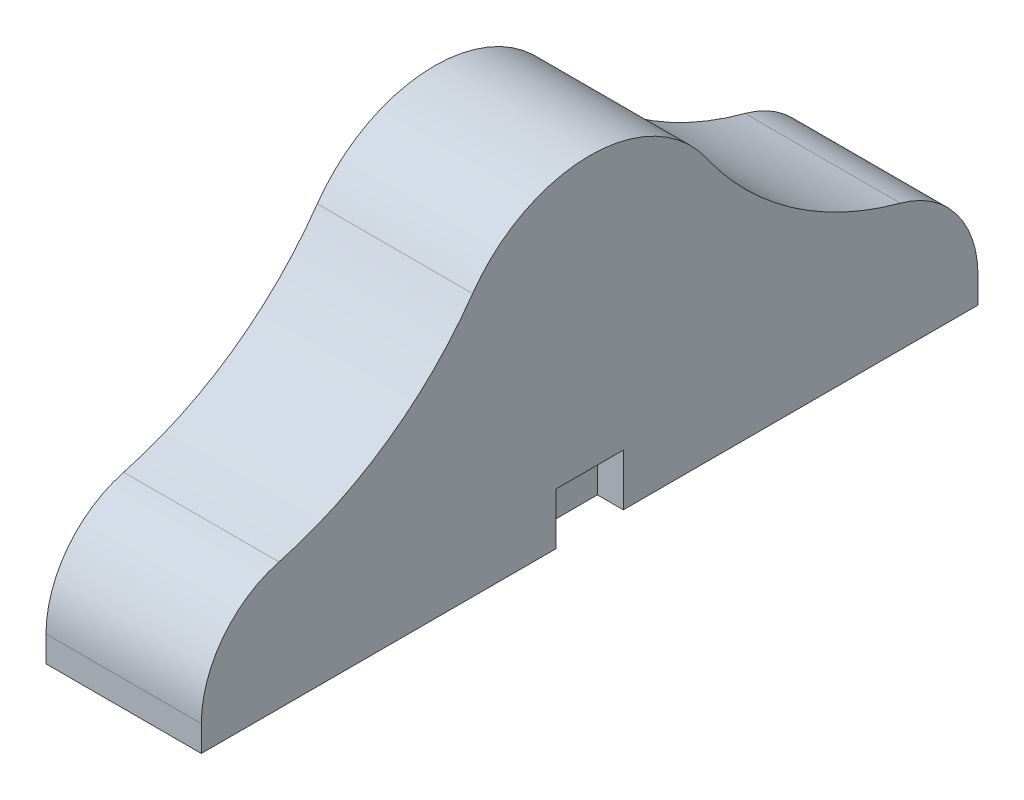
ISO-10303-21;
HEADER;
FILE_DESCRIPTION(('STEP AP214'),'2;1');
FILE_NAME('part.step','',(''),(''),'','','');
FILE_SCHEMA(('AUTOMOTIVE_DESIGN { 1 0 10303 214 1 1 1 1 }'));
ENDSEC;
DATA;
#1=APPLICATION_CONTEXT('core data for automotive mechanical design processes');
#2=APPLICATION_PROTOCOL_DEFINITION('international standard','automotive_design',2000,#1);
#3=PRODUCT_CONTEXT('',#1,'mechanical');
#4=PRODUCT('Part','Part','',(#3));
#5=PRODUCT_RELATED_PRODUCT_CATEGORY('part','',(#4));
#6=PRODUCT_DEFINITION_FORMATION('','',#4);
#7=PRODUCT_DEFINITION_CONTEXT('part definition',#1,'design');
#8=PRODUCT_DEFINITION('design','',#6,#7);
#9=PRODUCT_DEFINITION_SHAPE('','',#8);
#10=(LENGTH_UNIT() NAMED_UNIT(*) SI_UNIT(.MILLI.,.METRE.));
#11=(NAMED_UNIT(*) PLANE_ANGLE_UNIT() SI_UNIT($,.RADIAN.));
#12=(NAMED_UNIT(*) SI_UNIT($,.STERADIAN.) SOLID_ANGLE_UNIT());
#13=UNCERTAINTY_MEASURE_WITH_UNIT(LENGTH_MEASURE(1.E-05),#10,'distance_accuracy_value','');
#14=(GEOMETRIC_REPRESENTATION_CONTEXT(3) GLOBAL_UNCERTAINTY_ASSIGNED_CONTEXT((#13)) GLOBAL_UNIT_ASSIGNED_CONTEXT((#10,
#11,#12)) REPRESENTATION_CONTEXT('',''));
#15=CARTESIAN_POINT('',(0.,0.,0.));
#16=DIRECTION('',(0.,0.,1.));
#17=DIRECTION('',(1.,0.,0.));
#18=AXIS2_PLACEMENT_3D('',#15,#16,#17);
#19=CARTESIAN_POINT('',(0.,1.99999999999998,-8.09518911725141));
#20=DIRECTION('',(-1.,0.,0.));
#21=DIRECTION('',(0.,0.,1.));
#22=AXIS2_PLACEMENT_3D('',#19,#20,#21);
#23=PLANE('',#22);
#24=DIRECTION('',(0.,-1.,0.));
#25=VECTOR('',#24,1.);
#26=CARTESIAN_POINT('',(0.,4.,-32.6));
#27=LINE('',#26,#25);
#28=CARTESIAN_POINT('',(0.,2.,-32.6));
#29=VERTEX_POINT('',#28);
#30=CARTESIAN_POINT('',(0.,0.,-32.6));
#31=VERTEX_POINT('',#30);
#32=EDGE_CURVE('E11',#29,#31,#27,.T.);
#33=ORIENTED_EDGE('',*,*,#32,.F.);
#34=DIRECTION('',(0.,0.,-1.));
#35=VECTOR('',#34,1.);
#36=CARTESIAN_POINT('',(0.,2.,-27.4));
#37=LINE('',#36,#35);
#38=CARTESIAN_POINT('',(0.,2.,-27.4));
#39=VERTEX_POINT('',#38);
#40=EDGE_CURVE('E190',#39,#29,#37,.T.);
#41=ORIENTED_EDGE('',*,*,#40,.F.);
#42=DIRECTION('',(0.,1.,0.));
#43=VECTOR('',#42,1.);
#44=CARTESIAN_POINT('',(0.,0.,-27.4));
#45=LINE('',#44,#43);
#46=CARTESIAN_POINT('',(0.,0.,-27.4));
#47=VERTEX_POINT('',#46);
#48=EDGE_CURVE('E58',#47,#39,#45,.T.);
#49=ORIENTED_EDGE('',*,*,#48,.F.);
#50=DIRECTION('',(0.,0.,-1.));
#51=VECTOR('',#50,1.);
#52=CARTESIAN_POINT('',(0.,0.,0.));
#53=LINE('',#52,#51);
#54=EDGE_CURVE('E206',#47,#31,#53,.T.);
#55=ORIENTED_EDGE('',*,*,#54,.T.);
#56=EDGE_LOOP('',(#33,#41,#49,#55));
#57=FACE_BOUND('',#56,.T.);
#58=ADVANCED_FACE('F33',(#57),#23,.F.);
#59=CARTESIAN_POINT('',(-10.,0.,0.));
#60=DIRECTION('',(0.,0.,1.));
#61=DIRECTION('',(1.,0.,0.));
#62=AXIS2_PLACEMENT_3D('',#59,#60,#61);
#63=PLANE('',#62);
#64=DIRECTION('',(1.,0.,0.));
#65=VECTOR('',#64,1.);
#66=CARTESIAN_POINT('',(-10.,0.,0.));
#67=LINE('',#66,#65);
#68=CARTESIAN_POINT('',(-10.,0.,0.));
#69=VERTEX_POINT('',#68);
#70=CARTESIAN_POINT('',(2.,0.,0.));
#71=VERTEX_POINT('',#70);
#72=EDGE_CURVE('E37',#69,#71,#67,.T.);
#73=ORIENTED_EDGE('',*,*,#72,.T.);
#74=DIRECTION('',(0.,-1.,0.));
#75=VECTOR('',#74,1.);
#76=CARTESIAN_POINT('',(2.,2.,0.));
#77=LINE('',#76,#75);
#78=CARTESIAN_POINT('',(2.,2.,0.));
#79=VERTEX_POINT('',#78);
#80=EDGE_CURVE('E148',#79,#71,#77,.T.);
#81=ORIENTED_EDGE('',*,*,#80,.F.);
#82=DIRECTION('',(1.,0.,0.));
#83=VECTOR('',#82,1.);
#84=CARTESIAN_POINT('',(-10.,2.,0.));
#85=LINE('',#84,#83);
#86=CARTESIAN_POINT('',(-10.,2.,0.));
#87=VERTEX_POINT('',#86);
#88=EDGE_CURVE('E42',#87,#79,#85,.T.);
#89=ORIENTED_EDGE('',*,*,#88,.F.);
#90=DIRECTION('',(0.,-1.,0.));
#91=VECTOR('',#90,1.);
#92=CARTESIAN_POINT('',(-10.,0.,0.));
#93=LINE('',#92,#91);
#94=EDGE_CURVE('E212',#87,#69,#93,.T.);
#95=ORIENTED_EDGE('',*,*,#94,.T.);
#96=EDGE_LOOP('',(#73,#81,#89,#95));
#97=FACE_BOUND('',#96,.T.);
#98=ADVANCED_FACE('F35',(#97),#63,.T.);
#99=CARTESIAN_POINT('',(-10.,1.99999999999998,-8.09518911725141));
#100=DIRECTION('',(1.,0.,0.));
#101=DIRECTION('',(0.,0.,-1.));
#102=AXIS2_PLACEMENT_3D('',#99,#100,#101);
#103=CYLINDRICAL_SURFACE('',#102,8.09518911725142);
#104=ORIENTED_EDGE('',*,*,#88,.T.);
#105=CARTESIAN_POINT('',(2.,1.99999999999998,-8.09518911725141));
#106=DIRECTION('',(1.,0.,0.));
#107=DIRECTION('',(0.,0.,-1.));
#108=AXIS2_PLACEMENT_3D('',#105,#106,#107);
#109=CIRCLE('',#108,8.09518911725139);
#110=CARTESIAN_POINT('',(2.,9.81935223704725,-6.00000000000002));
#111=VERTEX_POINT('',#110);
#112=EDGE_CURVE('E139',#111,#79,#109,.T.);
#113=ORIENTED_EDGE('',*,*,#112,.F.);
#114=DIRECTION('',(1.,0.,0.));
#115=VECTOR('',#114,1.);
#116=CARTESIAN_POINT('',(-10.,9.81935223704729,-6.00000000000001));
#117=LINE('',#116,#115);
#118=CARTESIAN_POINT('',(-10.,9.81935223704729,-6.00000000000001));
#119=VERTEX_POINT('',#118);
#120=EDGE_CURVE('E145',#119,#111,#117,.T.);
#121=ORIENTED_EDGE('',*,*,#120,.F.);
#122=CARTESIAN_POINT('',(-10.,1.99999999999998,-8.09518911725141));
#123=DIRECTION('',(1.,0.,0.));
#124=DIRECTION('',(0.,0.,1.));
#125=AXIS2_PLACEMENT_3D('',#122,#123,#124);
#126=CIRCLE('',#125,8.09518911725142);
#127=EDGE_CURVE('E141',#119,#87,#126,.T.);
#128=ORIENTED_EDGE('',*,*,#127,.T.);
#129=EDGE_LOOP('',(#104,#113,#121,#128));
#130=FACE_BOUND('',#129,.T.);
#131=ADVANCED_FACE('F137',(#130),#103,.T.);
#132=CARTESIAN_POINT('',(-10.,35.6043590283356,0.909071746556974));
#133=DIRECTION('',(1.,0.,0.));
#134=DIRECTION('',(0.,0.,-1.));
#135=AXIS2_PLACEMENT_3D('',#132,#133,#134);
#136=CYLINDRICAL_SURFACE('',#135,26.6946033427331);
#137=ORIENTED_EDGE('',*,*,#120,.T.);
#138=CARTESIAN_POINT('',(2.,35.6043590283356,0.909071746556974));
#139=DIRECTION('',(-1.,0.,0.));
#140=DIRECTION('',(0.,0.,-1.));
#141=AXIS2_PLACEMENT_3D('',#138,#139,#140);
#142=CIRCLE('',#141,26.6946033427332);
#143=CARTESIAN_POINT('',(2.,20.2929635732061,-20.9578671531267));
#144=VERTEX_POINT('',#143);
#145=EDGE_CURVE('E157',#144,#111,#142,.T.);
#146=ORIENTED_EDGE('',*,*,#145,.F.);
#147=DIRECTION('',(1.,0.,0.));
#148=VECTOR('',#147,1.);
#149=CARTESIAN_POINT('',(-10.,20.2929635732061,-20.9578671531267));
#150=LINE('',#149,#148);
#151=CARTESIAN_POINT('',(-10.,20.2929635732061,-20.9578671531267));
#152=VERTEX_POINT('',#151);
#153=EDGE_CURVE('E236',#152,#144,#150,.T.);
#154=ORIENTED_EDGE('',*,*,#153,.F.);
#155=CARTESIAN_POINT('',(-10.,35.6043590283356,0.909071746556974));
#156=DIRECTION('',(-1.,0.,0.));
#157=DIRECTION('',(0.,0.,-1.));
#158=AXIS2_PLACEMENT_3D('',#155,#156,#157);
#159=CIRCLE('',#158,26.6946033427331);
#160=EDGE_CURVE('E229',#152,#119,#159,.T.);
#161=ORIENTED_EDGE('',*,*,#160,.T.);
#162=EDGE_LOOP('',(#137,#146,#154,#161));
#163=FACE_BOUND('',#162,.T.);
#164=ADVANCED_FACE('F271',(#163),#136,.F.);
#165=CARTESIAN_POINT('',(-10.,13.9615939923318,-30.));
#166=DIRECTION('',(1.,0.,0.));
#167=DIRECTION('',(0.,0.,-1.));
#168=AXIS2_PLACEMENT_3D('',#165,#166,#167);
#169=CYLINDRICAL_SURFACE('',#168,11.0384060076682);
#170=ORIENTED_EDGE('',*,*,#153,.T.);
#171=CARTESIAN_POINT('',(2.,13.9615939923318,-30.));
#172=DIRECTION('',(1.,0.,0.));
#173=DIRECTION('',(0.,0.,-1.));
#174=AXIS2_PLACEMENT_3D('',#171,#172,#173);
#175=CIRCLE('',#174,11.0384060076682);
#176=CARTESIAN_POINT('',(2.,20.2929635732061,-39.0421328468733));
#177=VERTEX_POINT('',#176);
#178=EDGE_CURVE('E182',#177,#144,#175,.T.);
#179=ORIENTED_EDGE('',*,*,#178,.F.);
#180=DIRECTION('',(1.,0.,0.));
#181=VECTOR('',#180,1.);
#182=CARTESIAN_POINT('',(-10.,20.292963573206,-39.0421328468733));
#183=LINE('',#182,#181);
#184=CARTESIAN_POINT('',(-10.,20.292963573206,-39.0421328468733));
#185=VERTEX_POINT('',#184);
#186=EDGE_CURVE('E238',#185,#177,#183,.T.);
#187=ORIENTED_EDGE('',*,*,#186,.F.);
#188=CARTESIAN_POINT('',(-10.,13.9615939923318,-30.));
#189=DIRECTION('',(1.,0.,0.));
#190=DIRECTION('',(0.,0.,1.));
#191=AXIS2_PLACEMENT_3D('',#188,#189,#190);
#192=CIRCLE('',#191,11.0384060076682);
#193=EDGE_CURVE('E226',#185,#152,#192,.T.);
#194=ORIENTED_EDGE('',*,*,#193,.T.);
#195=EDGE_LOOP('',(#170,#179,#187,#194));
#196=FACE_BOUND('',#195,.T.);
#197=ADVANCED_FACE('F269',(#196),#169,.T.);
#198=CARTESIAN_POINT('',(-10.,35.6043590283357,-60.909071746557));
#199=DIRECTION('',(1.,0.,0.));
#200=DIRECTION('',(0.,0.,-1.));
#201=AXIS2_PLACEMENT_3D('',#198,#199,#200);
#202=CYLINDRICAL_SURFACE('',#201,26.6946033427332);
#203=ORIENTED_EDGE('',*,*,#186,.T.);
#204=CARTESIAN_POINT('',(2.,35.6043590283357,-60.909071746557));
#205=DIRECTION('',(-1.,0.,0.));
#206=DIRECTION('',(0.,0.,-1.));
#207=AXIS2_PLACEMENT_3D('',#204,#205,#206);
#208=CIRCLE('',#207,26.6946033427332);
#209=CARTESIAN_POINT('',(2.,9.81935223704726,-54.));
#210=VERTEX_POINT('',#209);
#211=EDGE_CURVE('E179',#210,#177,#208,.T.);
#212=ORIENTED_EDGE('',*,*,#211,.F.);
#213=DIRECTION('',(1.,0.,0.));
#214=VECTOR('',#213,1.);
#215=CARTESIAN_POINT('',(-10.,9.81935223704726,-54.));
#216=LINE('',#215,#214);
#217=CARTESIAN_POINT('',(-10.,9.81935223704726,-54.));
#218=VERTEX_POINT('',#217);
#219=EDGE_CURVE('E240',#218,#210,#216,.T.);
#220=ORIENTED_EDGE('',*,*,#219,.F.);
#221=CARTESIAN_POINT('',(-10.,35.6043590283357,-60.909071746557));
#222=DIRECTION('',(-1.,0.,0.));
#223=DIRECTION('',(0.,0.,1.));
#224=AXIS2_PLACEMENT_3D('',#221,#222,#223);
#225=CIRCLE('',#224,26.6946033427332);
#226=EDGE_CURVE('E223',#218,#185,#225,.T.);
#227=ORIENTED_EDGE('',*,*,#226,.T.);
#228=EDGE_LOOP('',(#203,#212,#220,#227));
#229=FACE_BOUND('',#228,.T.);
#230=ADVANCED_FACE('F265',(#229),#202,.F.);
#231=CARTESIAN_POINT('',(-10.,2.,-51.9048108827487));
#232=DIRECTION('',(1.,0.,0.));
#233=DIRECTION('',(0.,0.,-1.));
#234=AXIS2_PLACEMENT_3D('',#231,#232,#233);
#235=CYLINDRICAL_SURFACE('',#234,8.09518911725134);
#236=ORIENTED_EDGE('',*,*,#219,.T.);
#237=CARTESIAN_POINT('',(2.,2.,-51.9048108827487));
#238=DIRECTION('',(1.,0.,0.));
#239=DIRECTION('',(0.,0.,-1.));
#240=AXIS2_PLACEMENT_3D('',#237,#238,#239);
#241=CIRCLE('',#240,8.09518911725134);
#242=CARTESIAN_POINT('',(2.,2.,-60.));
#243=VERTEX_POINT('',#242);
#244=EDGE_CURVE('E176',#243,#210,#241,.T.);
#245=ORIENTED_EDGE('',*,*,#244,.F.);
#246=DIRECTION('',(1.,0.,0.));
#247=VECTOR('',#246,1.);
#248=CARTESIAN_POINT('',(-10.,2.,-60.));
#249=LINE('',#248,#247);
#250=CARTESIAN_POINT('',(-10.,2.,-60.));
#251=VERTEX_POINT('',#250);
#252=EDGE_CURVE('E242',#251,#243,#249,.T.);
#253=ORIENTED_EDGE('',*,*,#252,.F.);
#254=CARTESIAN_POINT('',(-10.,2.,-51.9048108827487));
#255=DIRECTION('',(1.,0.,0.));
#256=DIRECTION('',(0.,0.,-1.));
#257=AXIS2_PLACEMENT_3D('',#254,#255,#256);
#258=CIRCLE('',#257,8.09518911725134);
#259=EDGE_CURVE('E220',#251,#218,#258,.T.);
#260=ORIENTED_EDGE('',*,*,#259,.T.);
#261=EDGE_LOOP('',(#236,#245,#253,#260));
#262=FACE_BOUND('',#261,.T.);
#263=ADVANCED_FACE('F258',(#262),#235,.T.);
#264=CARTESIAN_POINT('',(-10.,0.,-60.));
#265=DIRECTION('',(0.,0.,-1.));
#266=DIRECTION('',(-1.,0.,0.));
#267=AXIS2_PLACEMENT_3D('',#264,#265,#266);
#268=PLANE('',#267);
#269=ORIENTED_EDGE('',*,*,#252,.T.);
#270=DIRECTION('',(0.,1.,0.));
#271=VECTOR('',#270,1.);
#272=CARTESIAN_POINT('',(2.,0.,-60.));
#273=LINE('',#272,#271);
#274=CARTESIAN_POINT('',(2.,0.,-60.));
#275=VERTEX_POINT('',#274);
#276=EDGE_CURVE('E173',#275,#243,#273,.T.);
#277=ORIENTED_EDGE('',*,*,#276,.F.);
#278=DIRECTION('',(1.,0.,0.));
#279=VECTOR('',#278,1.);
#280=CARTESIAN_POINT('',(-10.,0.,-60.));
#281=LINE('',#280,#279);
#282=CARTESIAN_POINT('',(-10.,0.,-60.));
#283=VERTEX_POINT('',#282);
#284=EDGE_CURVE('E243',#283,#275,#281,.T.);
#285=ORIENTED_EDGE('',*,*,#284,.F.);
#286=DIRECTION('',(0.,1.,0.));
#287=VECTOR('',#286,1.);
#288=CARTESIAN_POINT('',(-10.,0.,-60.));
#289=LINE('',#288,#287);
#290=EDGE_CURVE('E217',#283,#251,#289,.T.);
#291=ORIENTED_EDGE('',*,*,#290,.T.);
#292=EDGE_LOOP('',(#269,#277,#285,#291));
#293=FACE_BOUND('',#292,.T.);
#294=ADVANCED_FACE('F255',(#293),#268,.T.);
#295=CARTESIAN_POINT('',(-10.,0.,0.));
#296=DIRECTION('',(0.,-1.,0.));
#297=DIRECTION('',(0.,0.,-1.));
#298=AXIS2_PLACEMENT_3D('',#295,#296,#297);
#299=PLANE('',#298);
#300=ORIENTED_EDGE('',*,*,#54,.F.);
#301=DIRECTION('',(-1.,0.,0.));
#302=VECTOR('',#301,1.);
#303=CARTESIAN_POINT('',(2.,0.,-27.4));
#304=LINE('',#303,#302);
#305=CARTESIAN_POINT('',(2.,0.,-27.4));
#306=VERTEX_POINT('',#305);
#307=EDGE_CURVE('E188',#306,#47,#304,.T.);
#308=ORIENTED_EDGE('',*,*,#307,.F.);
#309=DIRECTION('',(0.,0.,-1.));
#310=VECTOR('',#309,1.);
#311=CARTESIAN_POINT('',(2.,0.,0.));
#312=LINE('',#311,#310);
#313=EDGE_CURVE('E151',#71,#306,#312,.T.);
#314=ORIENTED_EDGE('',*,*,#313,.F.);
#315=ORIENTED_EDGE('',*,*,#72,.F.);
#316=DIRECTION('',(0.,0.,-1.));
#317=VECTOR('',#316,1.);
#318=CARTESIAN_POINT('',(-10.,0.,0.));
#319=LINE('',#318,#317);
#320=EDGE_CURVE('E214',#69,#283,#319,.T.);
#321=ORIENTED_EDGE('',*,*,#320,.T.);
#322=ORIENTED_EDGE('',*,*,#284,.T.);
#323=DIRECTION('',(0.,0.,-1.));
#324=VECTOR('',#323,1.);
#325=CARTESIAN_POINT('',(2.,0.,-32.6));
#326=LINE('',#325,#324);
#327=CARTESIAN_POINT('',(2.,0.,-32.6));
#328=VERTEX_POINT('',#327);
#329=EDGE_CURVE('E170',#328,#275,#326,.T.);
#330=ORIENTED_EDGE('',*,*,#329,.F.);
#331=DIRECTION('',(-1.,0.,0.));
#332=VECTOR('',#331,1.);
#333=CARTESIAN_POINT('',(2.,0.,-32.6));
#334=LINE('',#333,#332);
#335=EDGE_CURVE('E184',#328,#31,#334,.T.);
#336=ORIENTED_EDGE('',*,*,#335,.T.);
#337=EDGE_LOOP('',(#300,#308,#314,#315,#321,#322,#330,#336));
#338=FACE_BOUND('',#337,.T.);
#339=ADVANCED_FACE('F247',(#338),#299,.T.);
#340=CARTESIAN_POINT('',(-10.,1.99999999999998,-8.09518911725141));
#341=DIRECTION('',(-1.,0.,0.));
#342=DIRECTION('',(0.,0.,1.));
#343=AXIS2_PLACEMENT_3D('',#340,#341,#342);
#344=PLANE('',#343);
#345=DIRECTION('',(0.,-1.,0.));
#346=VECTOR('',#345,1.);
#347=CARTESIAN_POINT('',(-10.,2.,-27.4));
#348=LINE('',#347,#346);
#349=CARTESIAN_POINT('',(-10.,4.,-27.4));
#350=VERTEX_POINT('',#349);
#351=CARTESIAN_POINT('',(-10.,2.,-27.4));
#352=VERTEX_POINT('',#351);
#353=EDGE_CURVE('E191',#350,#352,#348,.T.);
#354=ORIENTED_EDGE('',*,*,#353,.T.);
#355=DIRECTION('',(0.,0.,-1.));
#356=VECTOR('',#355,1.);
#357=CARTESIAN_POINT('',(-10.,2.,-27.4));
#358=LINE('',#357,#356);
#359=CARTESIAN_POINT('',(-10.,2.,-32.6));
#360=VERTEX_POINT('',#359);
#361=EDGE_CURVE('E194',#352,#360,#358,.T.);
#362=ORIENTED_EDGE('',*,*,#361,.T.);
#363=DIRECTION('',(0.,1.,0.));
#364=VECTOR('',#363,1.);
#365=CARTESIAN_POINT('',(-10.,2.,-32.6));
#366=LINE('',#365,#364);
#367=CARTESIAN_POINT('',(-10.,4.,-32.6));
#368=VERTEX_POINT('',#367);
#369=EDGE_CURVE('E50',#360,#368,#366,.T.);
#370=ORIENTED_EDGE('',*,*,#369,.T.);
#371=DIRECTION('',(0.,0.,1.));
#372=VECTOR('',#371,1.);
#373=CARTESIAN_POINT('',(-10.,4.,-27.4));
#374=LINE('',#373,#372);
#375=EDGE_CURVE('E198',#368,#350,#374,.T.);
#376=ORIENTED_EDGE('',*,*,#375,.T.);
#377=EDGE_LOOP('',(#354,#362,#370,#376));
#378=FACE_BOUND('',#377,.T.);
#379=ORIENTED_EDGE('',*,*,#94,.F.);
#380=ORIENTED_EDGE('',*,*,#127,.F.);
#381=ORIENTED_EDGE('',*,*,#160,.F.);
#382=ORIENTED_EDGE('',*,*,#193,.F.);
#383=ORIENTED_EDGE('',*,*,#226,.F.);
#384=ORIENTED_EDGE('',*,*,#259,.F.);
#385=ORIENTED_EDGE('',*,*,#290,.F.);
#386=ORIENTED_EDGE('',*,*,#320,.F.);
#387=EDGE_LOOP('',(#379,#380,#381,#382,#383,#384,#385,#386));
#388=FACE_BOUND('',#387,.T.);
#389=ADVANCED_FACE('F261',(#378,#388),#344,.T.);
#390=CARTESIAN_POINT('',(-10.,2.,-27.4));
#391=DIRECTION('',(0.,0.,1.));
#392=DIRECTION('',(1.,0.,0.));
#393=AXIS2_PLACEMENT_3D('',#390,#391,#392);
#394=PLANE('',#393);
#395=DIRECTION('',(1.,0.,0.));
#396=VECTOR('',#395,1.);
#397=CARTESIAN_POINT('',(-10.,4.,-27.4));
#398=LINE('',#397,#396);
#399=CARTESIAN_POINT('',(2.,4.,-27.4));
#400=VERTEX_POINT('',#399);
#401=EDGE_CURVE('E204',#350,#400,#398,.T.);
#402=ORIENTED_EDGE('',*,*,#401,.T.);
#403=DIRECTION('',(0.,1.,0.));
#404=VECTOR('',#403,1.);
#405=CARTESIAN_POINT('',(2.,0.,-27.4));
#406=LINE('',#405,#404);
#407=EDGE_CURVE('E162',#306,#400,#406,.T.);
#408=ORIENTED_EDGE('',*,*,#407,.F.);
#409=ORIENTED_EDGE('',*,*,#307,.T.);
#410=ORIENTED_EDGE('',*,*,#48,.T.);
#411=DIRECTION('',(1.,0.,0.));
#412=VECTOR('',#411,1.);
#413=CARTESIAN_POINT('',(-10.,2.,-27.4));
#414=LINE('',#413,#412);
#415=EDGE_CURVE('E201',#352,#39,#414,.T.);
#416=ORIENTED_EDGE('',*,*,#415,.F.);
#417=ORIENTED_EDGE('',*,*,#353,.F.);
#418=EDGE_LOOP('',(#402,#408,#409,#410,#416,#417));
#419=FACE_BOUND('',#418,.T.);
#420=ADVANCED_FACE('F289',(#419),#394,.F.);
#421=CARTESIAN_POINT('',(-10.,4.,-27.4));
#422=DIRECTION('',(0.,1.,0.));
#423=DIRECTION('',(0.,0.,1.));
#424=AXIS2_PLACEMENT_3D('',#421,#422,#423);
#425=PLANE('',#424);
#426=DIRECTION('',(1.,0.,0.));
#427=VECTOR('',#426,1.);
#428=CARTESIAN_POINT('',(-10.,4.,-32.6));
#429=LINE('',#428,#427);
#430=CARTESIAN_POINT('',(2.,4.,-32.6));
#431=VERTEX_POINT('',#430);
#432=EDGE_CURVE('E207',#368,#431,#429,.T.);
#433=ORIENTED_EDGE('',*,*,#432,.T.);
#434=DIRECTION('',(0.,0.,-1.));
#435=VECTOR('',#434,1.);
#436=CARTESIAN_POINT('',(2.,4.,-27.4));
#437=LINE('',#436,#435);
#438=EDGE_CURVE('E165',#400,#431,#437,.T.);
#439=ORIENTED_EDGE('',*,*,#438,.F.);
#440=ORIENTED_EDGE('',*,*,#401,.F.);
#441=ORIENTED_EDGE('',*,*,#375,.F.);
#442=EDGE_LOOP('',(#433,#439,#440,#441));
#443=FACE_BOUND('',#442,.T.);
#444=ADVANCED_FACE('F293',(#443),#425,.F.);
#445=CARTESIAN_POINT('',(-10.,2.,-32.6));
#446=DIRECTION('',(0.,0.,-1.));
#447=DIRECTION('',(-1.,0.,0.));
#448=AXIS2_PLACEMENT_3D('',#445,#446,#447);
#449=PLANE('',#448);
#450=DIRECTION('',(1.,0.,0.));
#451=VECTOR('',#450,1.);
#452=CARTESIAN_POINT('',(-10.,2.,-32.6));
#453=LINE('',#452,#451);
#454=EDGE_CURVE('E209',#360,#29,#453,.T.);
#455=ORIENTED_EDGE('',*,*,#454,.T.);
#456=ORIENTED_EDGE('',*,*,#32,.T.);
#457=ORIENTED_EDGE('',*,*,#335,.F.);
#458=DIRECTION('',(0.,-1.,0.));
#459=VECTOR('',#458,1.);
#460=CARTESIAN_POINT('',(2.,4.,-32.6));
#461=LINE('',#460,#459);
#462=EDGE_CURVE('E168',#431,#328,#461,.T.);
#463=ORIENTED_EDGE('',*,*,#462,.F.);
#464=ORIENTED_EDGE('',*,*,#432,.F.);
#465=ORIENTED_EDGE('',*,*,#369,.F.);
#466=EDGE_LOOP('',(#455,#456,#457,#463,#464,#465));
#467=FACE_BOUND('',#466,.T.);
#468=ADVANCED_FACE('F297',(#467),#449,.F.);
#469=CARTESIAN_POINT('',(-10.,2.,-27.4));
#470=DIRECTION('',(0.,-1.,0.));
#471=DIRECTION('',(0.,0.,-1.));
#472=AXIS2_PLACEMENT_3D('',#469,#470,#471);
#473=PLANE('',#472);
#474=ORIENTED_EDGE('',*,*,#40,.T.);
#475=ORIENTED_EDGE('',*,*,#454,.F.);
#476=ORIENTED_EDGE('',*,*,#361,.F.);
#477=ORIENTED_EDGE('',*,*,#415,.T.);
#478=EDGE_LOOP('',(#474,#475,#476,#477));
#479=FACE_BOUND('',#478,.T.);
#480=ADVANCED_FACE('F294',(#479),#473,.F.);
#481=CARTESIAN_POINT('',(2.,1.99999999999998,-8.09518911725141));
#482=DIRECTION('',(1.,0.,0.));
#483=DIRECTION('',(0.,0.,-1.));
#484=AXIS2_PLACEMENT_3D('',#481,#482,#483);
#485=PLANE('',#484);
#486=ORIENTED_EDGE('',*,*,#112,.T.);
#487=ORIENTED_EDGE('',*,*,#80,.T.);
#488=ORIENTED_EDGE('',*,*,#313,.T.);
#489=ORIENTED_EDGE('',*,*,#407,.T.);
#490=ORIENTED_EDGE('',*,*,#438,.T.);
#491=ORIENTED_EDGE('',*,*,#462,.T.);
#492=ORIENTED_EDGE('',*,*,#329,.T.);
#493=ORIENTED_EDGE('',*,*,#276,.T.);
#494=ORIENTED_EDGE('',*,*,#244,.T.);
#495=ORIENTED_EDGE('',*,*,#211,.T.);
#496=ORIENTED_EDGE('',*,*,#178,.T.);
#497=ORIENTED_EDGE('',*,*,#145,.T.);
#498=EDGE_LOOP('',(#486,#487,#488,#489,#490,#491,#492,#493,#494,#495,#496,#497));
#499=FACE_BOUND('',#498,.T.);
#500=ADVANCED_FACE('F154',(#499),#485,.T.);
#501=CLOSED_SHELL('',(#58,#98,#131,#164,#197,#230,#263,#294,#339,#389,#420,#444,#468,#480,#500));
#502=MANIFOLD_SOLID_BREP('B2',#501);
#503=ADVANCED_BREP_SHAPE_REPRESENTATION('',(#18,#502),#14);
#504=SHAPE_DEFINITION_REPRESENTATION(#9,#503);
ENDSEC;
END-ISO-10303-21;
